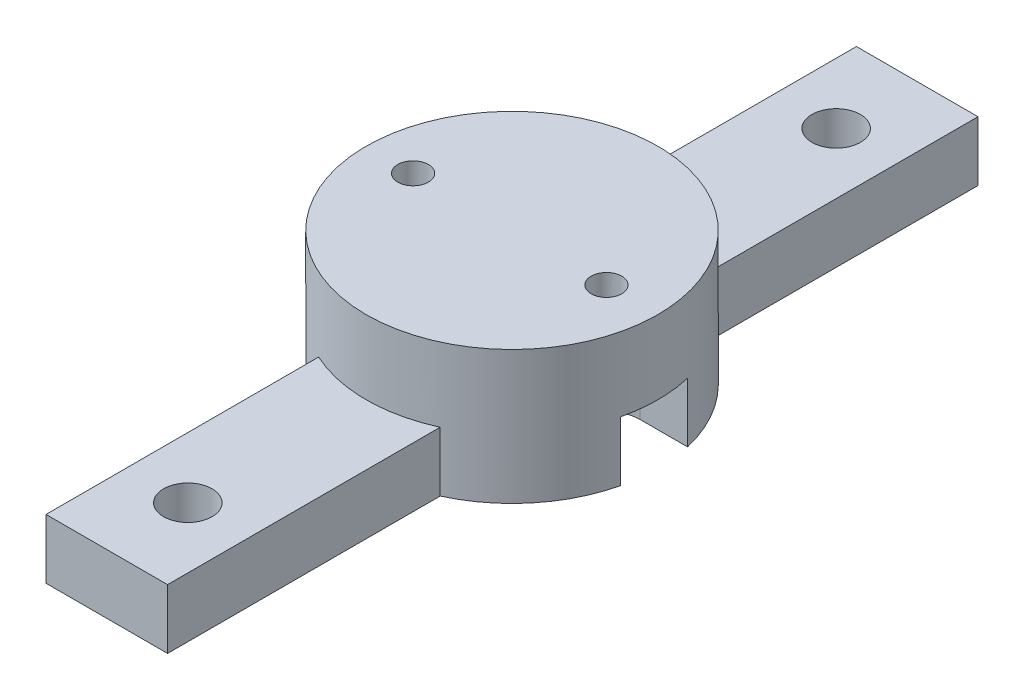
ISO-10303-21;
HEADER;
FILE_DESCRIPTION(('STEP AP214'),'2;1');
FILE_NAME('part.step','',(''),(''),'','','');
FILE_SCHEMA(('AUTOMOTIVE_DESIGN { 1 0 10303 214 1 1 1 1 }'));
ENDSEC;
DATA;
#1=APPLICATION_CONTEXT('core data for automotive mechanical design processes');
#2=APPLICATION_PROTOCOL_DEFINITION('international standard','automotive_design',2000,#1);
#3=PRODUCT_CONTEXT('',#1,'mechanical');
#4=PRODUCT('Part','Part','',(#3));
#5=PRODUCT_RELATED_PRODUCT_CATEGORY('part','',(#4));
#6=PRODUCT_DEFINITION_FORMATION('','',#4);
#7=PRODUCT_DEFINITION_CONTEXT('part definition',#1,'design');
#8=PRODUCT_DEFINITION('design','',#6,#7);
#9=PRODUCT_DEFINITION_SHAPE('','',#8);
#10=(LENGTH_UNIT() NAMED_UNIT(*) SI_UNIT(.MILLI.,.METRE.));
#11=(NAMED_UNIT(*) PLANE_ANGLE_UNIT() SI_UNIT($,.RADIAN.));
#12=(NAMED_UNIT(*) SI_UNIT($,.STERADIAN.) SOLID_ANGLE_UNIT());
#13=UNCERTAINTY_MEASURE_WITH_UNIT(LENGTH_MEASURE(1.E-05),#10,'distance_accuracy_value','');
#14=(GEOMETRIC_REPRESENTATION_CONTEXT(3) GLOBAL_UNCERTAINTY_ASSIGNED_CONTEXT((#13)) GLOBAL_UNIT_ASSIGNED_CONTEXT((#10,
#11,#12)) REPRESENTATION_CONTEXT('',''));
#15=CARTESIAN_POINT('',(0.,0.,0.));
#16=DIRECTION('',(0.,0.,1.));
#17=DIRECTION('',(1.,0.,0.));
#18=AXIS2_PLACEMENT_3D('',#15,#16,#17);
#19=CARTESIAN_POINT('',(0.,-4.671568,0.));
#20=DIRECTION('',(0.,1.,0.));
#21=DIRECTION('',(0.,0.,1.));
#22=AXIS2_PLACEMENT_3D('',#19,#20,#21);
#23=PLANE('',#22);
#24=CARTESIAN_POINT('',(0.,-4.671568,-25.4));
#25=DIRECTION('',(0.,-1.,0.));
#26=DIRECTION('',(0.,0.,-1.));
#27=AXIS2_PLACEMENT_3D('',#24,#25,#26);
#28=CIRCLE('',#27,1.89865);
#29=CARTESIAN_POINT('',(0.,-4.671568,-27.29865));
#30=VERTEX_POINT('',#29);
#31=EDGE_CURVE('E391',#30,#30,#28,.T.);
#32=ORIENTED_EDGE('',*,*,#31,.F.);
#33=EDGE_LOOP('',(#32));
#34=FACE_BOUND('',#33,.T.);
#35=CARTESIAN_POINT('',(0.,-4.671568,0.));
#36=DIRECTION('',(0.,1.,0.));
#37=DIRECTION('',(0.,0.,1.));
#38=AXIS2_PLACEMENT_3D('',#35,#36,#37);
#39=CIRCLE('',#38,11.43);
#40=CARTESIAN_POINT('',(-11.0326671186074,-4.671568,2.9875));
#41=VERTEX_POINT('',#40);
#42=CARTESIAN_POINT('',(-4.7625,-4.671568,10.3905482891905));
#43=VERTEX_POINT('',#42);
#44=EDGE_CURVE('E345',#41,#43,#39,.T.);
#45=ORIENTED_EDGE('',*,*,#44,.F.);
#46=DIRECTION('',(-1.,0.,0.));
#47=VECTOR('',#46,1.);
#48=CARTESIAN_POINT('',(-7.75,-4.671568,2.9875));
#49=LINE('',#48,#47);
#50=CARTESIAN_POINT('',(-7.75,-4.671568,2.9875));
#51=VERTEX_POINT('',#50);
#52=EDGE_CURVE('E346',#51,#41,#49,.T.);
#53=ORIENTED_EDGE('',*,*,#52,.F.);
#54=CARTESIAN_POINT('',(-7.75,-4.671568,0.));
#55=DIRECTION('',(0.,1.,0.));
#56=DIRECTION('',(0.,0.,1.));
#57=AXIS2_PLACEMENT_3D('',#54,#55,#56);
#58=CIRCLE('',#57,2.9875);
#59=CARTESIAN_POINT('',(-7.75,-4.671568,-2.9875));
#60=VERTEX_POINT('',#59);
#61=EDGE_CURVE('E167',#60,#51,#58,.F.);
#62=ORIENTED_EDGE('',*,*,#61,.F.);
#63=DIRECTION('',(1.,0.,0.));
#64=VECTOR('',#63,1.);
#65=CARTESIAN_POINT('',(-7.75,-4.671568,-2.9875));
#66=LINE('',#65,#64);
#67=CARTESIAN_POINT('',(-11.0326671186074,-4.671568,-2.9875));
#68=VERTEX_POINT('',#67);
#69=EDGE_CURVE('E351',#68,#60,#66,.T.);
#70=ORIENTED_EDGE('',*,*,#69,.F.);
#71=CARTESIAN_POINT('',(0.,-4.671568,0.));
#72=DIRECTION('',(0.,1.,0.));
#73=DIRECTION('',(0.,0.,1.));
#74=AXIS2_PLACEMENT_3D('',#71,#72,#73);
#75=CIRCLE('',#74,11.43);
#76=CARTESIAN_POINT('',(-4.7625,-4.671568,-10.3905482891905));
#77=VERTEX_POINT('',#76);
#78=EDGE_CURVE('E354',#77,#68,#75,.T.);
#79=ORIENTED_EDGE('',*,*,#78,.F.);
#80=DIRECTION('',(0.,0.,1.));
#81=VECTOR('',#80,1.);
#82=CARTESIAN_POINT('',(-4.7625,-4.671568,-31.75));
#83=LINE('',#82,#81);
#84=CARTESIAN_POINT('',(-4.7625,-4.671568,-31.75));
#85=VERTEX_POINT('',#84);
#86=EDGE_CURVE('E357',#85,#77,#83,.T.);
#87=ORIENTED_EDGE('',*,*,#86,.F.);
#88=DIRECTION('',(-1.,0.,0.));
#89=VECTOR('',#88,1.);
#90=CARTESIAN_POINT('',(4.7625,-4.671568,-31.75));
#91=LINE('',#90,#89);
#92=CARTESIAN_POINT('',(4.7625,-4.671568,-31.75));
#93=VERTEX_POINT('',#92);
#94=EDGE_CURVE('E360',#93,#85,#91,.T.);
#95=ORIENTED_EDGE('',*,*,#94,.F.);
#96=DIRECTION('',(0.,0.,-1.));
#97=VECTOR('',#96,1.);
#98=CARTESIAN_POINT('',(4.7625,-4.671568,-31.75));
#99=LINE('',#98,#97);
#100=CARTESIAN_POINT('',(4.7625,-4.671568,-10.3905482891905));
#101=VERTEX_POINT('',#100);
#102=EDGE_CURVE('E363',#101,#93,#99,.T.);
#103=ORIENTED_EDGE('',*,*,#102,.F.);
#104=CARTESIAN_POINT('',(0.,-4.671568,0.));
#105=DIRECTION('',(0.,1.,0.));
#106=DIRECTION('',(0.,0.,1.));
#107=AXIS2_PLACEMENT_3D('',#104,#105,#106);
#108=CIRCLE('',#107,11.43);
#109=CARTESIAN_POINT('',(11.1215328867023,-4.671568,-2.6375));
#110=VERTEX_POINT('',#109);
#111=EDGE_CURVE('E366',#110,#101,#108,.T.);
#112=ORIENTED_EDGE('',*,*,#111,.F.);
#113=DIRECTION('',(1.,0.,0.));
#114=VECTOR('',#113,1.);
#115=CARTESIAN_POINT('',(7.4,-4.671568,-2.6375));
#116=LINE('',#115,#114);
#117=CARTESIAN_POINT('',(7.4,-4.671568,-2.6375));
#118=VERTEX_POINT('',#117);
#119=EDGE_CURVE('E369',#118,#110,#116,.T.);
#120=ORIENTED_EDGE('',*,*,#119,.F.);
#121=CARTESIAN_POINT('',(7.4,-4.671568,0.));
#122=DIRECTION('',(0.,1.,0.));
#123=DIRECTION('',(0.,0.,1.));
#124=AXIS2_PLACEMENT_3D('',#121,#122,#123);
#125=CIRCLE('',#124,2.6375);
#126=CARTESIAN_POINT('',(7.4,-4.671568,2.6375));
#127=VERTEX_POINT('',#126);
#128=EDGE_CURVE('E372',#127,#118,#125,.F.);
#129=ORIENTED_EDGE('',*,*,#128,.F.);
#130=DIRECTION('',(-1.,0.,0.));
#131=VECTOR('',#130,1.);
#132=CARTESIAN_POINT('',(7.4,-4.671568,2.6375));
#133=LINE('',#132,#131);
#134=CARTESIAN_POINT('',(11.1215328867023,-4.671568,2.6375));
#135=VERTEX_POINT('',#134);
#136=EDGE_CURVE('E375',#135,#127,#133,.T.);
#137=ORIENTED_EDGE('',*,*,#136,.F.);
#138=CARTESIAN_POINT('',(0.,-4.671568,0.));
#139=DIRECTION('',(0.,1.,0.));
#140=DIRECTION('',(0.,0.,1.));
#141=AXIS2_PLACEMENT_3D('',#138,#139,#140);
#142=CIRCLE('',#141,11.43);
#143=CARTESIAN_POINT('',(4.7625,-4.671568,10.3905482891905));
#144=VERTEX_POINT('',#143);
#145=EDGE_CURVE('E378',#144,#135,#142,.T.);
#146=ORIENTED_EDGE('',*,*,#145,.F.);
#147=DIRECTION('',(0.,0.,-1.));
#148=VECTOR('',#147,1.);
#149=CARTESIAN_POINT('',(4.7625,-4.671568,10.3905482891905));
#150=LINE('',#149,#148);
#151=CARTESIAN_POINT('',(4.7625,-4.671568,31.75));
#152=VERTEX_POINT('',#151);
#153=EDGE_CURVE('E242',#152,#144,#150,.T.);
#154=ORIENTED_EDGE('',*,*,#153,.F.);
#155=DIRECTION('',(1.,0.,0.));
#156=VECTOR('',#155,1.);
#157=CARTESIAN_POINT('',(4.7625,-4.671568,31.75));
#158=LINE('',#157,#156);
#159=CARTESIAN_POINT('',(-4.7625,-4.671568,31.75));
#160=VERTEX_POINT('',#159);
#161=EDGE_CURVE('E239',#160,#152,#158,.T.);
#162=ORIENTED_EDGE('',*,*,#161,.F.);
#163=DIRECTION('',(0.,0.,1.));
#164=VECTOR('',#163,1.);
#165=CARTESIAN_POINT('',(-4.7625,-4.671568,10.3905482891905));
#166=LINE('',#165,#164);
#167=EDGE_CURVE('E250',#43,#160,#166,.T.);
#168=ORIENTED_EDGE('',*,*,#167,.F.);
#169=EDGE_LOOP('',(#45,#53,#62,#70,#79,#87,#95,#103,#112,#120,#129,#137,#146,#154,#162,#168));
#170=FACE_BOUND('',#169,.T.);
#171=CARTESIAN_POINT('',(0.,-4.671568,25.4));
#172=DIRECTION('',(0.,-1.,0.));
#173=DIRECTION('',(0.,0.,-1.));
#174=AXIS2_PLACEMENT_3D('',#171,#172,#173);
#175=CIRCLE('',#174,1.89865);
#176=CARTESIAN_POINT('',(0.,-4.671568,23.50135));
#177=VERTEX_POINT('',#176);
#178=EDGE_CURVE('E385',#177,#177,#175,.T.);
#179=ORIENTED_EDGE('',*,*,#178,.F.);
#180=EDGE_LOOP('',(#179));
#181=FACE_BOUND('',#180,.T.);
#182=ADVANCED_FACE('F39',(#34,#170,#181),#23,.F.);
#183=CARTESIAN_POINT('',(0.,0.,0.));
#184=DIRECTION('',(0.,1.,0.));
#185=DIRECTION('',(0.,0.,1.));
#186=AXIS2_PLACEMENT_3D('',#183,#184,#185);
#187=PLANE('',#186);
#188=CARTESIAN_POINT('',(7.4,0.,0.));
#189=DIRECTION('',(0.,1.,0.));
#190=DIRECTION('',(0.,0.,1.));
#191=AXIS2_PLACEMENT_3D('',#188,#189,#190);
#192=CIRCLE('',#191,1.2);
#193=CARTESIAN_POINT('',(7.4,0.,1.2));
#194=VERTEX_POINT('',#193);
#195=EDGE_CURVE('E247',#194,#194,#192,.T.);
#196=ORIENTED_EDGE('',*,*,#195,.T.);
#197=EDGE_LOOP('',(#196));
#198=FACE_BOUND('',#197,.T.);
#199=DIRECTION('',(1.,0.,0.));
#200=VECTOR('',#199,1.);
#201=CARTESIAN_POINT('',(7.4,0.,2.6375));
#202=LINE('',#201,#200);
#203=CARTESIAN_POINT('',(7.4,0.,2.6375));
#204=VERTEX_POINT('',#203);
#205=CARTESIAN_POINT('',(11.1215328867023,0.,2.6375));
#206=VERTEX_POINT('',#205);
#207=EDGE_CURVE('E55',#204,#206,#202,.T.);
#208=ORIENTED_EDGE('',*,*,#207,.F.);
#209=CARTESIAN_POINT('',(7.4,0.,0.));
#210=DIRECTION('',(0.,1.,0.));
#211=DIRECTION('',(0.,0.,-1.));
#212=AXIS2_PLACEMENT_3D('',#209,#210,#211);
#213=CIRCLE('',#212,2.6375);
#214=CARTESIAN_POINT('',(7.4,0.,-2.6375));
#215=VERTEX_POINT('',#214);
#216=EDGE_CURVE('E60',#215,#204,#213,.T.);
#217=ORIENTED_EDGE('',*,*,#216,.F.);
#218=DIRECTION('',(-1.,0.,0.));
#219=VECTOR('',#218,1.);
#220=CARTESIAN_POINT('',(7.4,0.,-2.6375));
#221=LINE('',#220,#219);
#222=CARTESIAN_POINT('',(11.1215328867023,0.,-2.6375));
#223=VERTEX_POINT('',#222);
#224=EDGE_CURVE('E193',#223,#215,#221,.T.);
#225=ORIENTED_EDGE('',*,*,#224,.F.);
#226=CARTESIAN_POINT('',(0.,0.,0.));
#227=DIRECTION('',(0.,1.,0.));
#228=DIRECTION('',(0.,0.,1.));
#229=AXIS2_PLACEMENT_3D('',#226,#227,#228);
#230=CIRCLE('',#229,11.43);
#231=EDGE_CURVE('E48',#206,#223,#230,.T.);
#232=ORIENTED_EDGE('',*,*,#231,.F.);
#233=EDGE_LOOP('',(#208,#217,#225,#232));
#234=FACE_BOUND('',#233,.T.);
#235=ADVANCED_FACE('F274',(#198,#234),#187,.F.);
#236=CARTESIAN_POINT('',(-7.75,0.,0.));
#237=DIRECTION('',(0.,1.,0.));
#238=DIRECTION('',(0.,0.,1.));
#239=AXIS2_PLACEMENT_3D('',#236,#237,#238);
#240=CIRCLE('',#239,1.2);
#241=CARTESIAN_POINT('',(-7.75,0.,1.2));
#242=VERTEX_POINT('',#241);
#243=EDGE_CURVE('E246',#242,#242,#240,.T.);
#244=ORIENTED_EDGE('',*,*,#243,.T.);
#245=EDGE_LOOP('',(#244));
#246=FACE_BOUND('',#245,.T.);
#247=DIRECTION('',(-1.,0.,0.));
#248=VECTOR('',#247,1.);
#249=CARTESIAN_POINT('',(-7.75,0.,-2.9875));
#250=LINE('',#249,#248);
#251=CARTESIAN_POINT('',(-7.75,0.,-2.9875));
#252=VERTEX_POINT('',#251);
#253=CARTESIAN_POINT('',(-11.0326671186074,0.,-2.9875));
#254=VERTEX_POINT('',#253);
#255=EDGE_CURVE('E158',#252,#254,#250,.T.);
#256=ORIENTED_EDGE('',*,*,#255,.F.);
#257=CARTESIAN_POINT('',(-7.75,0.,0.));
#258=DIRECTION('',(0.,1.,0.));
#259=DIRECTION('',(0.,0.,-1.));
#260=AXIS2_PLACEMENT_3D('',#257,#258,#259);
#261=CIRCLE('',#260,2.9875);
#262=CARTESIAN_POINT('',(-7.75,0.,2.9875));
#263=VERTEX_POINT('',#262);
#264=EDGE_CURVE('E151',#263,#252,#261,.T.);
#265=ORIENTED_EDGE('',*,*,#264,.F.);
#266=DIRECTION('',(1.,0.,0.));
#267=VECTOR('',#266,1.);
#268=CARTESIAN_POINT('',(-7.75,0.,2.9875));
#269=LINE('',#268,#267);
#270=CARTESIAN_POINT('',(-11.0326671186074,0.,2.9875));
#271=VERTEX_POINT('',#270);
#272=EDGE_CURVE('E155',#271,#263,#269,.T.);
#273=ORIENTED_EDGE('',*,*,#272,.F.);
#274=EDGE_CURVE('E405',#254,#271,#230,.T.);
#275=ORIENTED_EDGE('',*,*,#274,.F.);
#276=EDGE_LOOP('',(#256,#265,#273,#275));
#277=FACE_BOUND('',#276,.T.);
#278=ADVANCED_FACE('F153',(#246,#277),#187,.F.);
#279=CARTESIAN_POINT('',(0.,5.7785,0.));
#280=DIRECTION('',(0.,1.,0.));
#281=DIRECTION('',(0.,0.,1.));
#282=AXIS2_PLACEMENT_3D('',#279,#280,#281);
#283=PLANE('',#282);
#284=CARTESIAN_POINT('',(-7.75,5.7785,0.));
#285=DIRECTION('',(0.,1.,0.));
#286=DIRECTION('',(0.,0.,1.));
#287=AXIS2_PLACEMENT_3D('',#284,#285,#286);
#288=CIRCLE('',#287,1.2);
#289=CARTESIAN_POINT('',(-7.75,5.7785,1.2));
#290=VERTEX_POINT('',#289);
#291=EDGE_CURVE('E251',#290,#290,#288,.T.);
#292=ORIENTED_EDGE('',*,*,#291,.F.);
#293=EDGE_LOOP('',(#292));
#294=FACE_BOUND('',#293,.T.);
#295=CARTESIAN_POINT('',(0.,5.7785,0.));
#296=DIRECTION('',(0.,1.,0.));
#297=DIRECTION('',(0.,0.,1.));
#298=AXIS2_PLACEMENT_3D('',#295,#296,#297);
#299=CIRCLE('',#298,11.43);
#300=CARTESIAN_POINT('',(0.,5.7785,11.43));
#301=VERTEX_POINT('',#300);
#302=EDGE_CURVE('E12',#301,#301,#299,.T.);
#303=ORIENTED_EDGE('',*,*,#302,.T.);
#304=EDGE_LOOP('',(#303));
#305=FACE_BOUND('',#304,.T.);
#306=CARTESIAN_POINT('',(7.4,5.7785,0.));
#307=DIRECTION('',(0.,1.,0.));
#308=DIRECTION('',(0.,0.,1.));
#309=AXIS2_PLACEMENT_3D('',#306,#307,#308);
#310=CIRCLE('',#309,1.2);
#311=CARTESIAN_POINT('',(7.4,5.7785,1.2));
#312=VERTEX_POINT('',#311);
#313=EDGE_CURVE('E243',#312,#312,#310,.T.);
#314=ORIENTED_EDGE('',*,*,#313,.F.);
#315=EDGE_LOOP('',(#314));
#316=FACE_BOUND('',#315,.T.);
#317=ADVANCED_FACE('F270',(#294,#305,#316),#283,.T.);
#318=CARTESIAN_POINT('',(0.,5.7785,0.));
#319=DIRECTION('',(0.,-1.,0.));
#320=DIRECTION('',(0.,0.,-1.));
#321=AXIS2_PLACEMENT_3D('',#318,#319,#320);
#322=CYLINDRICAL_SURFACE('',#321,11.43);
#323=ORIENTED_EDGE('',*,*,#302,.F.);
#324=EDGE_LOOP('',(#323));
#325=FACE_BOUND('',#324,.T.);
#326=CARTESIAN_POINT('',(-4.7625,0.,10.3905482891905));
#327=VERTEX_POINT('',#326);
#328=CARTESIAN_POINT('',(4.7625,0.,10.3905482891905));
#329=VERTEX_POINT('',#328);
#330=EDGE_CURVE('E43',#327,#329,#230,.T.);
#331=ORIENTED_EDGE('',*,*,#330,.T.);
#332=DIRECTION('',(0.,1.,0.));
#333=VECTOR('',#332,1.);
#334=CARTESIAN_POINT('',(4.7625,-82.3753242102035,10.3905482891905));
#335=LINE('',#334,#333);
#336=EDGE_CURVE('E208',#144,#329,#335,.T.);
#337=ORIENTED_EDGE('',*,*,#336,.F.);
#338=ORIENTED_EDGE('',*,*,#145,.T.);
#339=DIRECTION('',(0.,1.,0.));
#340=VECTOR('',#339,1.);
#341=CARTESIAN_POINT('',(11.1215328867023,-82.3753242102035,2.6375));
#342=LINE('',#341,#340);
#343=EDGE_CURVE('E211',#135,#206,#342,.T.);
#344=ORIENTED_EDGE('',*,*,#343,.T.);
#345=ORIENTED_EDGE('',*,*,#231,.T.);
#346=DIRECTION('',(0.,1.,0.));
#347=VECTOR('',#346,1.);
#348=CARTESIAN_POINT('',(11.1215328867023,-82.3753242102035,-2.6375));
#349=LINE('',#348,#347);
#350=EDGE_CURVE('E218',#110,#223,#349,.T.);
#351=ORIENTED_EDGE('',*,*,#350,.F.);
#352=ORIENTED_EDGE('',*,*,#111,.T.);
#353=DIRECTION('',(0.,1.,0.));
#354=VECTOR('',#353,1.);
#355=CARTESIAN_POINT('',(4.7625,-82.3753242102035,-10.3905482891905));
#356=LINE('',#355,#354);
#357=CARTESIAN_POINT('',(4.7625,0.,-10.3905482891905));
#358=VERTEX_POINT('',#357);
#359=EDGE_CURVE('E221',#101,#358,#356,.T.);
#360=ORIENTED_EDGE('',*,*,#359,.T.);
#361=CARTESIAN_POINT('',(-4.7625,0.,-10.3905482891905));
#362=VERTEX_POINT('',#361);
#363=EDGE_CURVE('E402',#358,#362,#230,.T.);
#364=ORIENTED_EDGE('',*,*,#363,.T.);
#365=DIRECTION('',(0.,1.,0.));
#366=VECTOR('',#365,1.);
#367=CARTESIAN_POINT('',(-4.7625,-82.3753242102035,-10.3905482891905));
#368=LINE('',#367,#366);
#369=EDGE_CURVE('E228',#77,#362,#368,.T.);
#370=ORIENTED_EDGE('',*,*,#369,.F.);
#371=ORIENTED_EDGE('',*,*,#78,.T.);
#372=DIRECTION('',(0.,1.,0.));
#373=VECTOR('',#372,1.);
#374=CARTESIAN_POINT('',(-11.0326671186074,-82.3753242102035,-2.9875));
#375=LINE('',#374,#373);
#376=EDGE_CURVE('E231',#68,#254,#375,.T.);
#377=ORIENTED_EDGE('',*,*,#376,.T.);
#378=ORIENTED_EDGE('',*,*,#274,.T.);
#379=DIRECTION('',(0.,1.,0.));
#380=VECTOR('',#379,1.);
#381=CARTESIAN_POINT('',(-11.0326671186074,-82.3753242102035,2.9875));
#382=LINE('',#381,#380);
#383=EDGE_CURVE('E170',#41,#271,#382,.T.);
#384=ORIENTED_EDGE('',*,*,#383,.F.);
#385=ORIENTED_EDGE('',*,*,#44,.T.);
#386=DIRECTION('',(0.,1.,0.));
#387=VECTOR('',#386,1.);
#388=CARTESIAN_POINT('',(-4.7625,-82.3753242102035,10.3905482891905));
#389=LINE('',#388,#387);
#390=EDGE_CURVE('E236',#43,#327,#389,.T.);
#391=ORIENTED_EDGE('',*,*,#390,.T.);
#392=EDGE_LOOP('',(#331,#337,#338,#344,#345,#351,#352,#360,#364,#370,#371,#377,#378,#384,#385,#391));
#393=FACE_BOUND('',#392,.T.);
#394=ADVANCED_FACE('F41',(#325,#393),#322,.T.);
#395=CARTESIAN_POINT('',(-7.75,5.7785,0.));
#396=DIRECTION('',(0.,-1.,0.));
#397=DIRECTION('',(0.,0.,-1.));
#398=AXIS2_PLACEMENT_3D('',#395,#396,#397);
#399=CYLINDRICAL_SURFACE('',#398,1.2);
#400=ORIENTED_EDGE('',*,*,#291,.T.);
#401=EDGE_LOOP('',(#400));
#402=FACE_BOUND('',#401,.T.);
#403=ORIENTED_EDGE('',*,*,#243,.F.);
#404=EDGE_LOOP('',(#403));
#405=FACE_BOUND('',#404,.T.);
#406=ADVANCED_FACE('F258',(#402,#405),#399,.F.);
#407=CARTESIAN_POINT('',(7.4,5.7785,0.));
#408=DIRECTION('',(0.,-1.,0.));
#409=DIRECTION('',(0.,0.,-1.));
#410=AXIS2_PLACEMENT_3D('',#407,#408,#409);
#411=CYLINDRICAL_SURFACE('',#410,1.2);
#412=ORIENTED_EDGE('',*,*,#313,.T.);
#413=EDGE_LOOP('',(#412));
#414=FACE_BOUND('',#413,.T.);
#415=ORIENTED_EDGE('',*,*,#195,.F.);
#416=EDGE_LOOP('',(#415));
#417=FACE_BOUND('',#416,.T.);
#418=ADVANCED_FACE('F260',(#414,#417),#411,.F.);
#419=CARTESIAN_POINT('',(0.,0.,0.));
#420=DIRECTION('',(0.,-1.,0.));
#421=DIRECTION('',(0.,0.,-1.));
#422=AXIS2_PLACEMENT_3D('',#419,#420,#421);
#423=PLANE('',#422);
#424=CARTESIAN_POINT('',(0.,0.,-25.4));
#425=DIRECTION('',(0.,-1.,0.));
#426=DIRECTION('',(0.,0.,-1.));
#427=AXIS2_PLACEMENT_3D('',#424,#425,#426);
#428=CIRCLE('',#427,1.89865);
#429=CARTESIAN_POINT('',(0.,0.,-27.29865));
#430=VERTEX_POINT('',#429);
#431=EDGE_CURVE('E388',#430,#430,#428,.T.);
#432=ORIENTED_EDGE('',*,*,#431,.T.);
#433=EDGE_LOOP('',(#432));
#434=FACE_BOUND('',#433,.T.);
#435=ORIENTED_EDGE('',*,*,#363,.F.);
#436=DIRECTION('',(0.,0.,1.));
#437=VECTOR('',#436,1.);
#438=CARTESIAN_POINT('',(4.7625,0.,-31.75));
#439=LINE('',#438,#437);
#440=CARTESIAN_POINT('',(4.7625,0.,-31.75));
#441=VERTEX_POINT('',#440);
#442=EDGE_CURVE('E190',#441,#358,#439,.T.);
#443=ORIENTED_EDGE('',*,*,#442,.F.);
#444=DIRECTION('',(1.,0.,0.));
#445=VECTOR('',#444,1.);
#446=CARTESIAN_POINT('',(4.7625,0.,-31.75));
#447=LINE('',#446,#445);
#448=CARTESIAN_POINT('',(-4.7625,0.,-31.75));
#449=VERTEX_POINT('',#448);
#450=EDGE_CURVE('E187',#449,#441,#447,.T.);
#451=ORIENTED_EDGE('',*,*,#450,.F.);
#452=DIRECTION('',(0.,0.,-1.));
#453=VECTOR('',#452,1.);
#454=CARTESIAN_POINT('',(-4.7625,0.,-31.75));
#455=LINE('',#454,#453);
#456=EDGE_CURVE('E184',#362,#449,#455,.T.);
#457=ORIENTED_EDGE('',*,*,#456,.F.);
#458=EDGE_LOOP('',(#435,#443,#451,#457));
#459=FACE_BOUND('',#458,.T.);
#460=ADVANCED_FACE('F267',(#434,#459),#423,.F.);
#461=CARTESIAN_POINT('',(0.,0.,25.4));
#462=DIRECTION('',(0.,-1.,0.));
#463=DIRECTION('',(0.,0.,-1.));
#464=AXIS2_PLACEMENT_3D('',#461,#462,#463);
#465=CIRCLE('',#464,1.89865);
#466=CARTESIAN_POINT('',(0.,0.,23.50135));
#467=VERTEX_POINT('',#466);
#468=EDGE_CURVE('E179',#467,#467,#465,.T.);
#469=ORIENTED_EDGE('',*,*,#468,.T.);
#470=EDGE_LOOP('',(#469));
#471=FACE_BOUND('',#470,.T.);
#472=ORIENTED_EDGE('',*,*,#330,.F.);
#473=DIRECTION('',(0.,0.,-1.));
#474=VECTOR('',#473,1.);
#475=CARTESIAN_POINT('',(-4.7625,0.,10.3905482891905));
#476=LINE('',#475,#474);
#477=CARTESIAN_POINT('',(-4.7625,0.,31.75));
#478=VERTEX_POINT('',#477);
#479=EDGE_CURVE('E176',#478,#327,#476,.T.);
#480=ORIENTED_EDGE('',*,*,#479,.F.);
#481=DIRECTION('',(-1.,0.,0.));
#482=VECTOR('',#481,1.);
#483=CARTESIAN_POINT('',(4.7625,0.,31.75));
#484=LINE('',#483,#482);
#485=CARTESIAN_POINT('',(4.7625,0.,31.75));
#486=VERTEX_POINT('',#485);
#487=EDGE_CURVE('E201',#486,#478,#484,.T.);
#488=ORIENTED_EDGE('',*,*,#487,.F.);
#489=DIRECTION('',(0.,0.,1.));
#490=VECTOR('',#489,1.);
#491=CARTESIAN_POINT('',(4.7625,0.,10.3905482891905));
#492=LINE('',#491,#490);
#493=EDGE_CURVE('E198',#329,#486,#492,.T.);
#494=ORIENTED_EDGE('',*,*,#493,.F.);
#495=EDGE_LOOP('',(#472,#480,#488,#494));
#496=FACE_BOUND('',#495,.T.);
#497=ADVANCED_FACE('F287',(#471,#496),#423,.F.);
#498=CARTESIAN_POINT('',(4.7625,-82.3753242102035,31.75));
#499=DIRECTION('',(0.,0.,-1.));
#500=DIRECTION('',(-1.,0.,0.));
#501=AXIS2_PLACEMENT_3D('',#498,#499,#500);
#502=PLANE('',#501);
#503=DIRECTION('',(0.,1.,0.));
#504=VECTOR('',#503,1.);
#505=CARTESIAN_POINT('',(-4.7625,-82.3753242102035,31.75));
#506=LINE('',#505,#504);
#507=EDGE_CURVE('E204',#160,#478,#506,.T.);
#508=ORIENTED_EDGE('',*,*,#507,.F.);
#509=ORIENTED_EDGE('',*,*,#161,.T.);
#510=DIRECTION('',(0.,1.,0.));
#511=VECTOR('',#510,1.);
#512=CARTESIAN_POINT('',(4.7625,-82.3753242102035,31.75));
#513=LINE('',#512,#511);
#514=EDGE_CURVE('E206',#152,#486,#513,.T.);
#515=ORIENTED_EDGE('',*,*,#514,.T.);
#516=ORIENTED_EDGE('',*,*,#487,.T.);
#517=EDGE_LOOP('',(#508,#509,#515,#516));
#518=FACE_BOUND('',#517,.T.);
#519=ADVANCED_FACE('F290',(#518),#502,.F.);
#520=CARTESIAN_POINT('',(4.7625,-82.3753242102035,10.3905482891905));
#521=DIRECTION('',(-1.,0.,0.));
#522=DIRECTION('',(0.,0.,1.));
#523=AXIS2_PLACEMENT_3D('',#520,#521,#522);
#524=PLANE('',#523);
#525=ORIENTED_EDGE('',*,*,#514,.F.);
#526=ORIENTED_EDGE('',*,*,#153,.T.);
#527=ORIENTED_EDGE('',*,*,#336,.T.);
#528=ORIENTED_EDGE('',*,*,#493,.T.);
#529=EDGE_LOOP('',(#525,#526,#527,#528));
#530=FACE_BOUND('',#529,.T.);
#531=ADVANCED_FACE('F294',(#530),#524,.F.);
#532=CARTESIAN_POINT('',(7.4,-82.3753242102035,2.6375));
#533=DIRECTION('',(0.,0.,1.));
#534=DIRECTION('',(1.,0.,0.));
#535=AXIS2_PLACEMENT_3D('',#532,#533,#534);
#536=PLANE('',#535);
#537=ORIENTED_EDGE('',*,*,#343,.F.);
#538=ORIENTED_EDGE('',*,*,#136,.T.);
#539=DIRECTION('',(0.,1.,0.));
#540=VECTOR('',#539,1.);
#541=CARTESIAN_POINT('',(7.4,-82.3753242102035,2.6375));
#542=LINE('',#541,#540);
#543=EDGE_CURVE('E214',#127,#204,#542,.T.);
#544=ORIENTED_EDGE('',*,*,#543,.T.);
#545=ORIENTED_EDGE('',*,*,#207,.T.);
#546=EDGE_LOOP('',(#537,#538,#544,#545));
#547=FACE_BOUND('',#546,.T.);
#548=ADVANCED_FACE('F298',(#547),#536,.F.);
#549=CARTESIAN_POINT('',(7.4,-82.3753242102035,0.));
#550=DIRECTION('',(0.,1.,0.));
#551=DIRECTION('',(0.,0.,1.));
#552=AXIS2_PLACEMENT_3D('',#549,#550,#551);
#553=CYLINDRICAL_SURFACE('',#552,2.6375);
#554=ORIENTED_EDGE('',*,*,#543,.F.);
#555=ORIENTED_EDGE('',*,*,#128,.T.);
#556=DIRECTION('',(0.,1.,0.));
#557=VECTOR('',#556,1.);
#558=CARTESIAN_POINT('',(7.4,-82.3753242102035,-2.6375));
#559=LINE('',#558,#557);
#560=EDGE_CURVE('E216',#118,#215,#559,.T.);
#561=ORIENTED_EDGE('',*,*,#560,.T.);
#562=ORIENTED_EDGE('',*,*,#216,.T.);
#563=EDGE_LOOP('',(#554,#555,#561,#562));
#564=FACE_BOUND('',#563,.T.);
#565=ADVANCED_FACE('F302',(#564),#553,.F.);
#566=CARTESIAN_POINT('',(7.4,-82.3753242102035,-2.6375));
#567=DIRECTION('',(0.,0.,-1.));
#568=DIRECTION('',(-1.,0.,0.));
#569=AXIS2_PLACEMENT_3D('',#566,#567,#568);
#570=PLANE('',#569);
#571=ORIENTED_EDGE('',*,*,#560,.F.);
#572=ORIENTED_EDGE('',*,*,#119,.T.);
#573=ORIENTED_EDGE('',*,*,#350,.T.);
#574=ORIENTED_EDGE('',*,*,#224,.T.);
#575=EDGE_LOOP('',(#571,#572,#573,#574));
#576=FACE_BOUND('',#575,.T.);
#577=ADVANCED_FACE('F306',(#576),#570,.F.);
#578=CARTESIAN_POINT('',(4.7625,-82.3753242102035,-31.75));
#579=DIRECTION('',(-1.,0.,0.));
#580=DIRECTION('',(0.,0.,1.));
#581=AXIS2_PLACEMENT_3D('',#578,#579,#580);
#582=PLANE('',#581);
#583=ORIENTED_EDGE('',*,*,#359,.F.);
#584=ORIENTED_EDGE('',*,*,#102,.T.);
#585=DIRECTION('',(0.,1.,0.));
#586=VECTOR('',#585,1.);
#587=CARTESIAN_POINT('',(4.7625,-82.3753242102035,-31.75));
#588=LINE('',#587,#586);
#589=EDGE_CURVE('E224',#93,#441,#588,.T.);
#590=ORIENTED_EDGE('',*,*,#589,.T.);
#591=ORIENTED_EDGE('',*,*,#442,.T.);
#592=EDGE_LOOP('',(#583,#584,#590,#591));
#593=FACE_BOUND('',#592,.T.);
#594=ADVANCED_FACE('F310',(#593),#582,.F.);
#595=CARTESIAN_POINT('',(4.7625,-82.3753242102035,-31.75));
#596=DIRECTION('',(0.,0.,1.));
#597=DIRECTION('',(1.,0.,0.));
#598=AXIS2_PLACEMENT_3D('',#595,#596,#597);
#599=PLANE('',#598);
#600=ORIENTED_EDGE('',*,*,#589,.F.);
#601=ORIENTED_EDGE('',*,*,#94,.T.);
#602=DIRECTION('',(0.,1.,0.));
#603=VECTOR('',#602,1.);
#604=CARTESIAN_POINT('',(-4.7625,-82.3753242102035,-31.75));
#605=LINE('',#604,#603);
#606=EDGE_CURVE('E226',#85,#449,#605,.T.);
#607=ORIENTED_EDGE('',*,*,#606,.T.);
#608=ORIENTED_EDGE('',*,*,#450,.T.);
#609=EDGE_LOOP('',(#600,#601,#607,#608));
#610=FACE_BOUND('',#609,.T.);
#611=ADVANCED_FACE('F314',(#610),#599,.F.);
#612=CARTESIAN_POINT('',(-4.7625,-82.3753242102035,-31.75));
#613=DIRECTION('',(1.,0.,0.));
#614=DIRECTION('',(0.,0.,-1.));
#615=AXIS2_PLACEMENT_3D('',#612,#613,#614);
#616=PLANE('',#615);
#617=ORIENTED_EDGE('',*,*,#606,.F.);
#618=ORIENTED_EDGE('',*,*,#86,.T.);
#619=ORIENTED_EDGE('',*,*,#369,.T.);
#620=ORIENTED_EDGE('',*,*,#456,.T.);
#621=EDGE_LOOP('',(#617,#618,#619,#620));
#622=FACE_BOUND('',#621,.T.);
#623=ADVANCED_FACE('F318',(#622),#616,.F.);
#624=CARTESIAN_POINT('',(-7.75,-82.3753242102035,-2.9875));
#625=DIRECTION('',(0.,0.,-1.));
#626=DIRECTION('',(-1.,0.,0.));
#627=AXIS2_PLACEMENT_3D('',#624,#625,#626);
#628=PLANE('',#627);
#629=ORIENTED_EDGE('',*,*,#376,.F.);
#630=ORIENTED_EDGE('',*,*,#69,.T.);
#631=DIRECTION('',(0.,1.,0.));
#632=VECTOR('',#631,1.);
#633=CARTESIAN_POINT('',(-7.75,-82.3753242102035,-2.9875));
#634=LINE('',#633,#632);
#635=EDGE_CURVE('E171',#60,#252,#634,.T.);
#636=ORIENTED_EDGE('',*,*,#635,.T.);
#637=ORIENTED_EDGE('',*,*,#255,.T.);
#638=EDGE_LOOP('',(#629,#630,#636,#637));
#639=FACE_BOUND('',#638,.T.);
#640=ADVANCED_FACE('F322',(#639),#628,.F.);
#641=CARTESIAN_POINT('',(-7.75,-82.3753242102035,0.));
#642=DIRECTION('',(0.,1.,0.));
#643=DIRECTION('',(0.,0.,1.));
#644=AXIS2_PLACEMENT_3D('',#641,#642,#643);
#645=CYLINDRICAL_SURFACE('',#644,2.9875);
#646=ORIENTED_EDGE('',*,*,#635,.F.);
#647=ORIENTED_EDGE('',*,*,#61,.T.);
#648=DIRECTION('',(0.,1.,0.));
#649=VECTOR('',#648,1.);
#650=CARTESIAN_POINT('',(-7.75,-82.3753242102035,2.9875));
#651=LINE('',#650,#649);
#652=EDGE_CURVE('E165',#51,#263,#651,.T.);
#653=ORIENTED_EDGE('',*,*,#652,.T.);
#654=ORIENTED_EDGE('',*,*,#264,.T.);
#655=EDGE_LOOP('',(#646,#647,#653,#654));
#656=FACE_BOUND('',#655,.T.);
#657=ADVANCED_FACE('F166',(#656),#645,.F.);
#658=CARTESIAN_POINT('',(-7.75,-82.3753242102035,2.9875));
#659=DIRECTION('',(0.,0.,1.));
#660=DIRECTION('',(1.,0.,0.));
#661=AXIS2_PLACEMENT_3D('',#658,#659,#660);
#662=PLANE('',#661);
#663=ORIENTED_EDGE('',*,*,#652,.F.);
#664=ORIENTED_EDGE('',*,*,#52,.T.);
#665=ORIENTED_EDGE('',*,*,#383,.T.);
#666=ORIENTED_EDGE('',*,*,#272,.T.);
#667=EDGE_LOOP('',(#663,#664,#665,#666));
#668=FACE_BOUND('',#667,.T.);
#669=ADVANCED_FACE('F174',(#668),#662,.F.);
#670=CARTESIAN_POINT('',(-4.7625,-82.3753242102035,10.3905482891905));
#671=DIRECTION('',(1.,0.,0.));
#672=DIRECTION('',(0.,0.,-1.));
#673=AXIS2_PLACEMENT_3D('',#670,#671,#672);
#674=PLANE('',#673);
#675=ORIENTED_EDGE('',*,*,#390,.F.);
#676=ORIENTED_EDGE('',*,*,#167,.T.);
#677=ORIENTED_EDGE('',*,*,#507,.T.);
#678=ORIENTED_EDGE('',*,*,#479,.T.);
#679=EDGE_LOOP('',(#675,#676,#677,#678));
#680=FACE_BOUND('',#679,.T.);
#681=ADVANCED_FACE('F331',(#680),#674,.F.);
#682=CARTESIAN_POINT('',(0.,-4.671568,25.4));
#683=DIRECTION('',(0.,-1.,0.));
#684=DIRECTION('',(0.,0.,-1.));
#685=AXIS2_PLACEMENT_3D('',#682,#683,#684);
#686=CYLINDRICAL_SURFACE('',#685,1.89865);
#687=ORIENTED_EDGE('',*,*,#178,.T.);
#688=EDGE_LOOP('',(#687));
#689=FACE_BOUND('',#688,.T.);
#690=ORIENTED_EDGE('',*,*,#468,.F.);
#691=EDGE_LOOP('',(#690));
#692=FACE_BOUND('',#691,.T.);
#693=ADVANCED_FACE('F285',(#689,#692),#686,.F.);
#694=CARTESIAN_POINT('',(0.,-4.671568,-25.4));
#695=DIRECTION('',(0.,-1.,0.));
#696=DIRECTION('',(0.,0.,-1.));
#697=AXIS2_PLACEMENT_3D('',#694,#695,#696);
#698=CYLINDRICAL_SURFACE('',#697,1.89865);
#699=ORIENTED_EDGE('',*,*,#31,.T.);
#700=EDGE_LOOP('',(#699));
#701=FACE_BOUND('',#700,.T.);
#702=ORIENTED_EDGE('',*,*,#431,.F.);
#703=EDGE_LOOP('',(#702));
#704=FACE_BOUND('',#703,.T.);
#705=ADVANCED_FACE('F337',(#701,#704),#698,.F.);
#706=CLOSED_SHELL('',(#182,#235,#278,#317,#394,#406,#418,#460,#497,#519,#531,#548,#565,#577,
#594,#611,#623,#640,#657,#669,#681,#693,#705));
#707=MANIFOLD_SOLID_BREP('B2',#706);
#708=ADVANCED_BREP_SHAPE_REPRESENTATION('',(#18,#707),#14);
#709=SHAPE_DEFINITION_REPRESENTATION(#9,#708);
ENDSEC;
END-ISO-10303-21;
